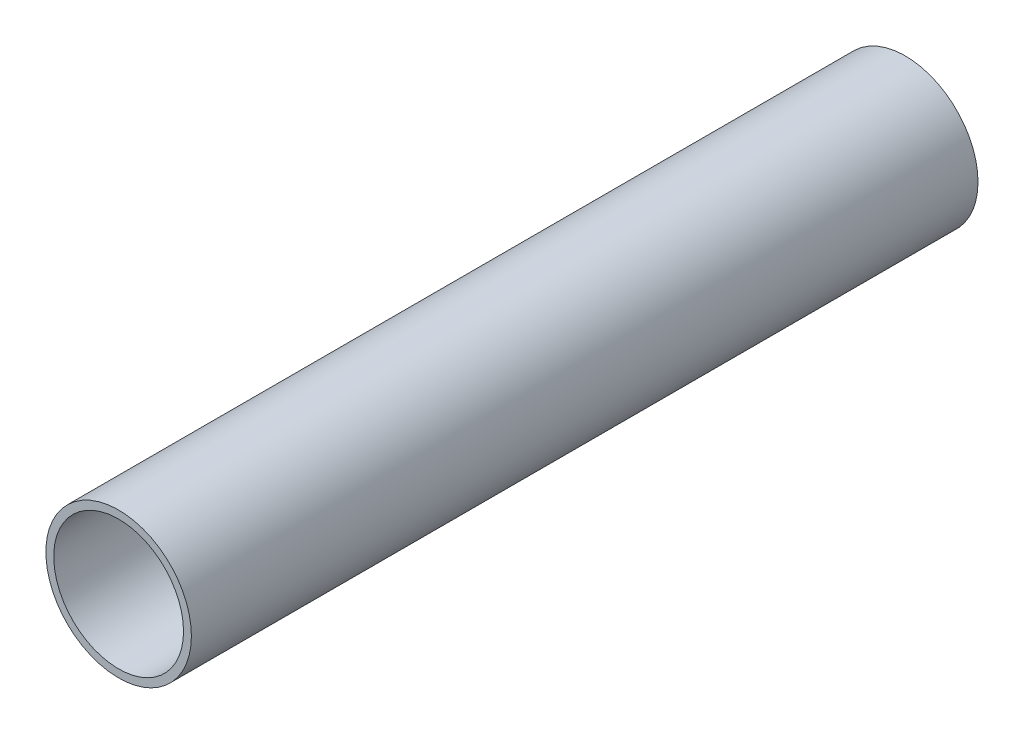
ISO-10303-21;
HEADER;
FILE_DESCRIPTION(('STEP AP214'),'2;1');
FILE_NAME('part.step','',(''),(''),'','','');
FILE_SCHEMA(('AUTOMOTIVE_DESIGN { 1 0 10303 214 1 1 1 1 }'));
ENDSEC;
DATA;
#1=APPLICATION_CONTEXT('core data for automotive mechanical design processes');
#2=APPLICATION_PROTOCOL_DEFINITION('international standard','automotive_design',2000,#1);
#3=PRODUCT_CONTEXT('',#1,'mechanical');
#4=PRODUCT('Part','Part','',(#3));
#5=PRODUCT_RELATED_PRODUCT_CATEGORY('part','',(#4));
#6=PRODUCT_DEFINITION_FORMATION('','',#4);
#7=PRODUCT_DEFINITION_CONTEXT('part definition',#1,'design');
#8=PRODUCT_DEFINITION('design','',#6,#7);
#9=PRODUCT_DEFINITION_SHAPE('','',#8);
#10=(LENGTH_UNIT() NAMED_UNIT(*) SI_UNIT(.MILLI.,.METRE.));
#11=(NAMED_UNIT(*) PLANE_ANGLE_UNIT() SI_UNIT($,.RADIAN.));
#12=(NAMED_UNIT(*) SI_UNIT($,.STERADIAN.) SOLID_ANGLE_UNIT());
#13=UNCERTAINTY_MEASURE_WITH_UNIT(LENGTH_MEASURE(1.E-05),#10,'distance_accuracy_value','');
#14=(GEOMETRIC_REPRESENTATION_CONTEXT(3) GLOBAL_UNCERTAINTY_ASSIGNED_CONTEXT((#13)) GLOBAL_UNIT_ASSIGNED_CONTEXT((#10,
#11,#12)) REPRESENTATION_CONTEXT('',''));
#15=CARTESIAN_POINT('',(0.,0.,0.));
#16=DIRECTION('',(0.,0.,1.));
#17=DIRECTION('',(1.,0.,0.));
#18=AXIS2_PLACEMENT_3D('',#15,#16,#17);
#19=CARTESIAN_POINT('',(0.,0.,-254.));
#20=DIRECTION('',(0.,0.,1.));
#21=DIRECTION('',(1.,0.,0.));
#22=AXIS2_PLACEMENT_3D('',#19,#20,#21);
#23=CYLINDRICAL_SURFACE('',#22,23.495);
#24=CARTESIAN_POINT('',(0.,0.,-254.));
#25=DIRECTION('',(0.,0.,1.));
#26=DIRECTION('',(1.,0.,0.));
#27=AXIS2_PLACEMENT_3D('',#24,#25,#26);
#28=CIRCLE('',#27,23.495);
#29=CARTESIAN_POINT('',(23.495,0.,-254.));
#30=VERTEX_POINT('',#29);
#31=EDGE_CURVE('E10',#30,#30,#28,.T.);
#32=ORIENTED_EDGE('',*,*,#31,.T.);
#33=EDGE_LOOP('',(#32));
#34=FACE_BOUND('',#33,.T.);
#35=CARTESIAN_POINT('',(0.,0.,0.));
#36=DIRECTION('',(0.,0.,1.));
#37=DIRECTION('',(1.,0.,0.));
#38=AXIS2_PLACEMENT_3D('',#35,#36,#37);
#39=CIRCLE('',#38,23.495);
#40=CARTESIAN_POINT('',(23.495,0.,0.));
#41=VERTEX_POINT('',#40);
#42=EDGE_CURVE('E38',#41,#41,#39,.T.);
#43=ORIENTED_EDGE('',*,*,#42,.F.);
#44=EDGE_LOOP('',(#43));
#45=FACE_BOUND('',#44,.T.);
#46=ADVANCED_FACE('F35',(#34,#45),#23,.T.);
#47=CARTESIAN_POINT('',(0.,0.,-254.));
#48=DIRECTION('',(0.,0.,1.));
#49=DIRECTION('',(1.,0.,0.));
#50=AXIS2_PLACEMENT_3D('',#47,#48,#49);
#51=PLANE('',#50);
#52=CARTESIAN_POINT('',(0.,0.,-254.));
#53=DIRECTION('',(0.,0.,1.));
#54=DIRECTION('',(1.,0.,0.));
#55=AXIS2_PLACEMENT_3D('',#52,#53,#54);
#56=CIRCLE('',#55,20.955);
#57=CARTESIAN_POINT('',(20.955,0.,-254.));
#58=VERTEX_POINT('',#57);
#59=EDGE_CURVE('E48',#58,#58,#56,.T.);
#60=ORIENTED_EDGE('',*,*,#59,.T.);
#61=EDGE_LOOP('',(#60));
#62=FACE_BOUND('',#61,.T.);
#63=ORIENTED_EDGE('',*,*,#31,.F.);
#64=EDGE_LOOP('',(#63));
#65=FACE_BOUND('',#64,.T.);
#66=ADVANCED_FACE('F57',(#62,#65),#51,.F.);
#67=CARTESIAN_POINT('',(0.,0.,0.));
#68=DIRECTION('',(0.,0.,1.));
#69=DIRECTION('',(1.,0.,0.));
#70=AXIS2_PLACEMENT_3D('',#67,#68,#69);
#71=PLANE('',#70);
#72=CARTESIAN_POINT('',(0.,0.,0.));
#73=DIRECTION('',(0.,0.,1.));
#74=DIRECTION('',(1.,0.,0.));
#75=AXIS2_PLACEMENT_3D('',#72,#73,#74);
#76=CIRCLE('',#75,20.955);
#77=CARTESIAN_POINT('',(20.955,0.,0.));
#78=VERTEX_POINT('',#77);
#79=EDGE_CURVE('E50',#78,#78,#76,.T.);
#80=ORIENTED_EDGE('',*,*,#79,.F.);
#81=EDGE_LOOP('',(#80));
#82=FACE_BOUND('',#81,.T.);
#83=ORIENTED_EDGE('',*,*,#42,.T.);
#84=EDGE_LOOP('',(#83));
#85=FACE_BOUND('',#84,.T.);
#86=ADVANCED_FACE('F63',(#82,#85),#71,.T.);
#87=CARTESIAN_POINT('',(0.,0.,-254.));
#88=DIRECTION('',(0.,0.,1.));
#89=DIRECTION('',(1.,0.,0.));
#90=AXIS2_PLACEMENT_3D('',#87,#88,#89);
#91=CYLINDRICAL_SURFACE('',#90,20.955);
#92=ORIENTED_EDGE('',*,*,#59,.F.);
#93=EDGE_LOOP('',(#92));
#94=FACE_BOUND('',#93,.T.);
#95=ORIENTED_EDGE('',*,*,#79,.T.);
#96=EDGE_LOOP('',(#95));
#97=FACE_BOUND('',#96,.T.);
#98=ADVANCED_FACE('F60',(#94,#97),#91,.F.);
#99=CLOSED_SHELL('',(#46,#66,#86,#98));
#100=MANIFOLD_SOLID_BREP('B2',#99);
#101=ADVANCED_BREP_SHAPE_REPRESENTATION('',(#18,#100),#14);
#102=SHAPE_DEFINITION_REPRESENTATION(#9,#101);
ENDSEC;
END-ISO-10303-21;
